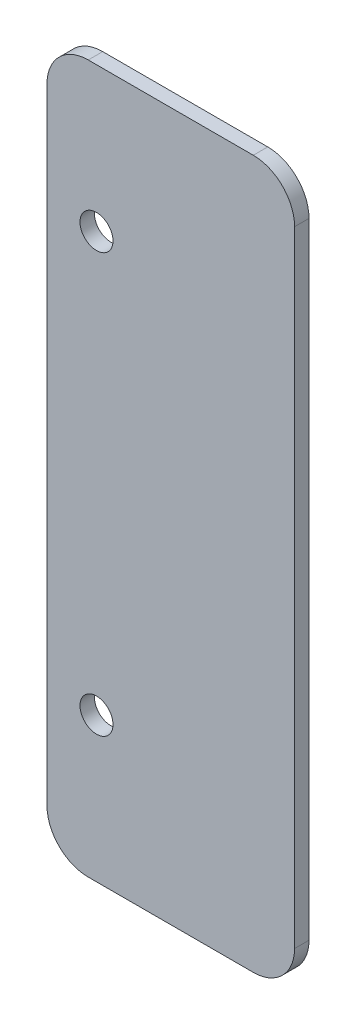
ISO-10303-21;
HEADER;
FILE_DESCRIPTION(('STEP AP214'),'2;1');
FILE_NAME('part.step','',(''),(''),'','','');
FILE_SCHEMA(('AUTOMOTIVE_DESIGN { 1 0 10303 214 1 1 1 1 }'));
ENDSEC;
DATA;
#1=APPLICATION_CONTEXT('core data for automotive mechanical design processes');
#2=APPLICATION_PROTOCOL_DEFINITION('international standard','automotive_design',2000,#1);
#3=PRODUCT_CONTEXT('',#1,'mechanical');
#4=PRODUCT('Part','Part','',(#3));
#5=PRODUCT_RELATED_PRODUCT_CATEGORY('part','',(#4));
#6=PRODUCT_DEFINITION_FORMATION('','',#4);
#7=PRODUCT_DEFINITION_CONTEXT('part definition',#1,'design');
#8=PRODUCT_DEFINITION('design','',#6,#7);
#9=PRODUCT_DEFINITION_SHAPE('','',#8);
#10=(LENGTH_UNIT() NAMED_UNIT(*) SI_UNIT(.MILLI.,.METRE.));
#11=(NAMED_UNIT(*) PLANE_ANGLE_UNIT() SI_UNIT($,.RADIAN.));
#12=(NAMED_UNIT(*) SI_UNIT($,.STERADIAN.) SOLID_ANGLE_UNIT());
#13=UNCERTAINTY_MEASURE_WITH_UNIT(LENGTH_MEASURE(1.E-05),#10,'distance_accuracy_value','');
#14=(GEOMETRIC_REPRESENTATION_CONTEXT(3) GLOBAL_UNCERTAINTY_ASSIGNED_CONTEXT((#13)) GLOBAL_UNIT_ASSIGNED_CONTEXT((#10,
#11,#12)) REPRESENTATION_CONTEXT('',''));
#15=CARTESIAN_POINT('',(0.,0.,0.));
#16=DIRECTION('',(0.,0.,1.));
#17=DIRECTION('',(1.,0.,0.));
#18=AXIS2_PLACEMENT_3D('',#15,#16,#17);
#19=CARTESIAN_POINT('',(2302.,-93.7499999999999,3.5));
#20=DIRECTION('',(0.,1.,0.));
#21=DIRECTION('',(0.,0.,1.));
#22=AXIS2_PLACEMENT_3D('',#19,#20,#21);
#23=PLANE('',#22);
#24=DIRECTION('',(1.,0.,0.));
#25=VECTOR('',#24,1.);
#26=CARTESIAN_POINT('',(2302.,-93.7499999999999,3.5));
#27=LINE('',#26,#25);
#28=CARTESIAN_POINT('',(2312.,-93.7499999999999,3.5));
#29=VERTEX_POINT('',#28);
#30=CARTESIAN_POINT('',(2352.,-93.7499999999999,3.5));
#31=VERTEX_POINT('',#30);
#32=EDGE_CURVE('E118',#29,#31,#27,.T.);
#33=ORIENTED_EDGE('',*,*,#32,.F.);
#34=DIRECTION('',(0.,0.,-1.));
#35=VECTOR('',#34,1.);
#36=CARTESIAN_POINT('',(2312.,-93.7499999999999,0.));
#37=LINE('',#36,#35);
#38=CARTESIAN_POINT('',(2312.,-93.7499999999999,0.));
#39=VERTEX_POINT('',#38);
#40=EDGE_CURVE('E103',#29,#39,#37,.T.);
#41=ORIENTED_EDGE('',*,*,#40,.T.);
#42=DIRECTION('',(1.,0.,0.));
#43=VECTOR('',#42,1.);
#44=CARTESIAN_POINT('',(2302.,-93.7499999999999,0.));
#45=LINE('',#44,#43);
#46=CARTESIAN_POINT('',(2352.,-93.7499999999999,0.));
#47=VERTEX_POINT('',#46);
#48=EDGE_CURVE('E115',#39,#47,#45,.T.);
#49=ORIENTED_EDGE('',*,*,#48,.T.);
#50=DIRECTION('',(0.,0.,-1.));
#51=VECTOR('',#50,1.);
#52=CARTESIAN_POINT('',(2352.,-93.7499999999999,3.5));
#53=LINE('',#52,#51);
#54=EDGE_CURVE('E120',#47,#31,#53,.F.);
#55=ORIENTED_EDGE('',*,*,#54,.T.);
#56=EDGE_LOOP('',(#33,#41,#49,#55));
#57=FACE_BOUND('',#56,.T.);
#58=ADVANCED_FACE('F34',(#57),#23,.F.);
#59=CARTESIAN_POINT('',(2362.,-93.7499999999999,3.5));
#60=DIRECTION('',(-1.,0.,0.));
#61=DIRECTION('',(0.,0.,1.));
#62=AXIS2_PLACEMENT_3D('',#59,#60,#61);
#63=PLANE('',#62);
#64=DIRECTION('',(0.,1.,0.));
#65=VECTOR('',#64,1.);
#66=CARTESIAN_POINT('',(2362.,-93.7499999999999,3.5));
#67=LINE('',#66,#65);
#68=CARTESIAN_POINT('',(2362.,-83.7499999999999,3.5));
#69=VERTEX_POINT('',#68);
#70=CARTESIAN_POINT('',(2362.,67.7500000000003,3.5));
#71=VERTEX_POINT('',#70);
#72=EDGE_CURVE('E173',#69,#71,#67,.T.);
#73=ORIENTED_EDGE('',*,*,#72,.F.);
#74=DIRECTION('',(0.,0.,-1.));
#75=VECTOR('',#74,1.);
#76=CARTESIAN_POINT('',(2362.,-83.7499999999999,3.5));
#77=LINE('',#76,#75);
#78=CARTESIAN_POINT('',(2362.,-83.7499999999999,0.));
#79=VERTEX_POINT('',#78);
#80=EDGE_CURVE('E158',#69,#79,#77,.T.);
#81=ORIENTED_EDGE('',*,*,#80,.T.);
#82=DIRECTION('',(0.,1.,0.));
#83=VECTOR('',#82,1.);
#84=CARTESIAN_POINT('',(2362.,-93.7499999999999,0.));
#85=LINE('',#84,#83);
#86=CARTESIAN_POINT('',(2362.,67.7500000000003,0.));
#87=VERTEX_POINT('',#86);
#88=EDGE_CURVE('E124',#79,#87,#85,.T.);
#89=ORIENTED_EDGE('',*,*,#88,.T.);
#90=DIRECTION('',(0.,0.,-1.));
#91=VECTOR('',#90,1.);
#92=CARTESIAN_POINT('',(2362.,67.7500000000003,3.5));
#93=LINE('',#92,#91);
#94=EDGE_CURVE('E156',#87,#71,#93,.F.);
#95=ORIENTED_EDGE('',*,*,#94,.T.);
#96=EDGE_LOOP('',(#73,#81,#89,#95));
#97=FACE_BOUND('',#96,.T.);
#98=ADVANCED_FACE('F212',(#97),#63,.F.);
#99=CARTESIAN_POINT('',(2302.,77.7500000000003,3.5));
#100=DIRECTION('',(0.,1.,0.));
#101=DIRECTION('',(0.,0.,1.));
#102=AXIS2_PLACEMENT_3D('',#99,#100,#101);
#103=PLANE('',#102);
#104=DIRECTION('',(1.,0.,0.));
#105=VECTOR('',#104,1.);
#106=CARTESIAN_POINT('',(2302.,77.7500000000003,0.));
#107=LINE('',#106,#105);
#108=CARTESIAN_POINT('',(2312.,77.7500000000003,0.));
#109=VERTEX_POINT('',#108);
#110=CARTESIAN_POINT('',(2352.,77.7500000000003,0.));
#111=VERTEX_POINT('',#110);
#112=EDGE_CURVE('E128',#109,#111,#107,.T.);
#113=ORIENTED_EDGE('',*,*,#112,.F.);
#114=DIRECTION('',(0.,0.,-1.));
#115=VECTOR('',#114,1.);
#116=CARTESIAN_POINT('',(2312.,77.7500000000003,3.5));
#117=LINE('',#116,#115);
#118=CARTESIAN_POINT('',(2312.,77.7500000000003,3.5));
#119=VERTEX_POINT('',#118);
#120=EDGE_CURVE('E11',#109,#119,#117,.F.);
#121=ORIENTED_EDGE('',*,*,#120,.T.);
#122=DIRECTION('',(1.,0.,0.));
#123=VECTOR('',#122,1.);
#124=CARTESIAN_POINT('',(2302.,77.7500000000003,3.5));
#125=LINE('',#124,#123);
#126=CARTESIAN_POINT('',(2352.,77.7500000000003,3.5));
#127=VERTEX_POINT('',#126);
#128=EDGE_CURVE('E163',#119,#127,#125,.T.);
#129=ORIENTED_EDGE('',*,*,#128,.T.);
#130=DIRECTION('',(0.,0.,-1.));
#131=VECTOR('',#130,1.);
#132=CARTESIAN_POINT('',(2352.,77.7500000000003,0.));
#133=LINE('',#132,#131);
#134=EDGE_CURVE('E42',#127,#111,#133,.T.);
#135=ORIENTED_EDGE('',*,*,#134,.T.);
#136=EDGE_LOOP('',(#113,#121,#129,#135));
#137=FACE_BOUND('',#136,.T.);
#138=ADVANCED_FACE('F162',(#137),#103,.T.);
#139=CARTESIAN_POINT('',(2302.,-93.7499999999999,3.5));
#140=DIRECTION('',(-1.,0.,0.));
#141=DIRECTION('',(0.,0.,1.));
#142=AXIS2_PLACEMENT_3D('',#139,#140,#141);
#143=PLANE('',#142);
#144=DIRECTION('',(0.,1.,0.));
#145=VECTOR('',#144,1.);
#146=CARTESIAN_POINT('',(2302.,-93.7499999999999,0.));
#147=LINE('',#146,#145);
#148=CARTESIAN_POINT('',(2302.,-83.7499999999999,0.));
#149=VERTEX_POINT('',#148);
#150=CARTESIAN_POINT('',(2302.,67.7500000000003,0.));
#151=VERTEX_POINT('',#150);
#152=EDGE_CURVE('E139',#149,#151,#147,.T.);
#153=ORIENTED_EDGE('',*,*,#152,.F.);
#154=DIRECTION('',(0.,0.,-1.));
#155=VECTOR('',#154,1.);
#156=CARTESIAN_POINT('',(2302.,-83.7499999999999,3.5));
#157=LINE('',#156,#155);
#158=CARTESIAN_POINT('',(2302.,-83.7499999999999,3.5));
#159=VERTEX_POINT('',#158);
#160=EDGE_CURVE('E104',#149,#159,#157,.F.);
#161=ORIENTED_EDGE('',*,*,#160,.T.);
#162=DIRECTION('',(0.,1.,0.));
#163=VECTOR('',#162,1.);
#164=CARTESIAN_POINT('',(2302.,-93.7499999999999,3.5));
#165=LINE('',#164,#163);
#166=CARTESIAN_POINT('',(2302.,67.7500000000003,3.5));
#167=VERTEX_POINT('',#166);
#168=EDGE_CURVE('E134',#159,#167,#165,.T.);
#169=ORIENTED_EDGE('',*,*,#168,.T.);
#170=DIRECTION('',(0.,0.,-1.));
#171=VECTOR('',#170,1.);
#172=CARTESIAN_POINT('',(2302.,67.7500000000003,3.5));
#173=LINE('',#172,#171);
#174=EDGE_CURVE('E109',#167,#151,#173,.T.);
#175=ORIENTED_EDGE('',*,*,#174,.T.);
#176=EDGE_LOOP('',(#153,#161,#169,#175));
#177=FACE_BOUND('',#176,.T.);
#178=ADVANCED_FACE('F171',(#177),#143,.T.);
#179=CARTESIAN_POINT('',(0.,0.,3.5));
#180=DIRECTION('',(0.,0.,1.));
#181=DIRECTION('',(1.,0.,0.));
#182=AXIS2_PLACEMENT_3D('',#179,#180,#181);
#183=PLANE('',#182);
#184=CARTESIAN_POINT('',(2314.,42.7500000000003,3.5));
#185=DIRECTION('',(0.,0.,1.));
#186=DIRECTION('',(1.,0.,0.));
#187=AXIS2_PLACEMENT_3D('',#184,#185,#186);
#188=CIRCLE('',#187,4.00000000000021);
#189=CARTESIAN_POINT('',(2318.,42.7500000000003,3.5));
#190=VERTEX_POINT('',#189);
#191=EDGE_CURVE('E131',#190,#190,#188,.T.);
#192=ORIENTED_EDGE('',*,*,#191,.F.);
#193=EDGE_LOOP('',(#192));
#194=FACE_BOUND('',#193,.T.);
#195=CARTESIAN_POINT('',(2314.,-58.7499999999999,3.5));
#196=DIRECTION('',(0.,0.,1.));
#197=DIRECTION('',(1.,0.,0.));
#198=AXIS2_PLACEMENT_3D('',#195,#196,#197);
#199=CIRCLE('',#198,4.00000000000021);
#200=CARTESIAN_POINT('',(2318.,-58.7499999999999,3.5));
#201=VERTEX_POINT('',#200);
#202=EDGE_CURVE('E180',#201,#201,#199,.T.);
#203=ORIENTED_EDGE('',*,*,#202,.F.);
#204=EDGE_LOOP('',(#203));
#205=FACE_BOUND('',#204,.T.);
#206=ORIENTED_EDGE('',*,*,#168,.F.);
#207=CARTESIAN_POINT('',(2312.,-83.7499999999999,3.5));
#208=DIRECTION('',(0.,0.,1.));
#209=DIRECTION('',(1.,0.,0.));
#210=AXIS2_PLACEMENT_3D('',#207,#208,#209);
#211=CIRCLE('',#210,10.);
#212=EDGE_CURVE('E154',#159,#29,#211,.T.);
#213=ORIENTED_EDGE('',*,*,#212,.T.);
#214=ORIENTED_EDGE('',*,*,#32,.T.);
#215=CARTESIAN_POINT('',(2352.,-83.7499999999999,3.5));
#216=DIRECTION('',(0.,0.,1.));
#217=DIRECTION('',(1.,0.,0.));
#218=AXIS2_PLACEMENT_3D('',#215,#216,#217);
#219=CIRCLE('',#218,10.);
#220=EDGE_CURVE('E152',#31,#69,#219,.T.);
#221=ORIENTED_EDGE('',*,*,#220,.T.);
#222=ORIENTED_EDGE('',*,*,#72,.T.);
#223=CARTESIAN_POINT('',(2352.,67.7500000000003,3.5));
#224=DIRECTION('',(0.,0.,1.));
#225=DIRECTION('',(1.,0.,0.));
#226=AXIS2_PLACEMENT_3D('',#223,#224,#225);
#227=CIRCLE('',#226,10.);
#228=EDGE_CURVE('E49',#71,#127,#227,.T.);
#229=ORIENTED_EDGE('',*,*,#228,.T.);
#230=ORIENTED_EDGE('',*,*,#128,.F.);
#231=CARTESIAN_POINT('',(2312.,67.7500000000003,3.5));
#232=DIRECTION('',(0.,0.,1.));
#233=DIRECTION('',(1.,0.,0.));
#234=AXIS2_PLACEMENT_3D('',#231,#232,#233);
#235=CIRCLE('',#234,10.);
#236=EDGE_CURVE('E150',#119,#167,#235,.T.);
#237=ORIENTED_EDGE('',*,*,#236,.T.);
#238=EDGE_LOOP('',(#206,#213,#214,#221,#222,#229,#230,#237));
#239=FACE_BOUND('',#238,.T.);
#240=ADVANCED_FACE('F189',(#194,#205,#239),#183,.T.);
#241=CARTESIAN_POINT('',(0.,0.,0.));
#242=DIRECTION('',(0.,0.,1.));
#243=DIRECTION('',(1.,0.,0.));
#244=AXIS2_PLACEMENT_3D('',#241,#242,#243);
#245=PLANE('',#244);
#246=CARTESIAN_POINT('',(2314.,42.7500000000003,0.));
#247=DIRECTION('',(0.,0.,1.));
#248=DIRECTION('',(1.,0.,0.));
#249=AXIS2_PLACEMENT_3D('',#246,#247,#248);
#250=CIRCLE('',#249,4.00000000000021);
#251=CARTESIAN_POINT('',(2318.,42.7500000000003,0.));
#252=VERTEX_POINT('',#251);
#253=EDGE_CURVE('E125',#252,#252,#250,.F.);
#254=ORIENTED_EDGE('',*,*,#253,.F.);
#255=EDGE_LOOP('',(#254));
#256=FACE_BOUND('',#255,.T.);
#257=CARTESIAN_POINT('',(2314.,-58.7499999999999,0.));
#258=DIRECTION('',(0.,0.,1.));
#259=DIRECTION('',(1.,0.,0.));
#260=AXIS2_PLACEMENT_3D('',#257,#258,#259);
#261=CIRCLE('',#260,4.00000000000021);
#262=CARTESIAN_POINT('',(2318.,-58.7499999999999,0.));
#263=VERTEX_POINT('',#262);
#264=EDGE_CURVE('E177',#263,#263,#261,.F.);
#265=ORIENTED_EDGE('',*,*,#264,.F.);
#266=EDGE_LOOP('',(#265));
#267=FACE_BOUND('',#266,.T.);
#268=ORIENTED_EDGE('',*,*,#48,.F.);
#269=CARTESIAN_POINT('',(2312.,-83.7499999999999,0.));
#270=DIRECTION('',(0.,0.,1.));
#271=DIRECTION('',(1.,0.,0.));
#272=AXIS2_PLACEMENT_3D('',#269,#270,#271);
#273=CIRCLE('',#272,10.);
#274=EDGE_CURVE('E99',#39,#149,#273,.F.);
#275=ORIENTED_EDGE('',*,*,#274,.T.);
#276=ORIENTED_EDGE('',*,*,#152,.T.);
#277=CARTESIAN_POINT('',(2312.,67.7500000000003,0.));
#278=DIRECTION('',(0.,0.,1.));
#279=DIRECTION('',(1.,0.,0.));
#280=AXIS2_PLACEMENT_3D('',#277,#278,#279);
#281=CIRCLE('',#280,10.);
#282=EDGE_CURVE('E143',#151,#109,#281,.F.);
#283=ORIENTED_EDGE('',*,*,#282,.T.);
#284=ORIENTED_EDGE('',*,*,#112,.T.);
#285=CARTESIAN_POINT('',(2352.,67.7500000000003,0.));
#286=DIRECTION('',(0.,0.,1.));
#287=DIRECTION('',(1.,0.,0.));
#288=AXIS2_PLACEMENT_3D('',#285,#286,#287);
#289=CIRCLE('',#288,10.);
#290=EDGE_CURVE('E119',#111,#87,#289,.F.);
#291=ORIENTED_EDGE('',*,*,#290,.T.);
#292=ORIENTED_EDGE('',*,*,#88,.F.);
#293=CARTESIAN_POINT('',(2352.,-83.7499999999999,0.));
#294=DIRECTION('',(0.,0.,1.));
#295=DIRECTION('',(1.,0.,0.));
#296=AXIS2_PLACEMENT_3D('',#293,#294,#295);
#297=CIRCLE('',#296,10.);
#298=EDGE_CURVE('E110',#79,#47,#297,.F.);
#299=ORIENTED_EDGE('',*,*,#298,.T.);
#300=EDGE_LOOP('',(#268,#275,#276,#283,#284,#291,#292,#299));
#301=FACE_BOUND('',#300,.T.);
#302=ADVANCED_FACE('F122',(#256,#267,#301),#245,.F.);
#303=CARTESIAN_POINT('',(2312.,-83.7499999999999,3.5));
#304=DIRECTION('',(0.,0.,1.));
#305=DIRECTION('',(1.,0.,0.));
#306=AXIS2_PLACEMENT_3D('',#303,#304,#305);
#307=CYLINDRICAL_SURFACE('',#306,10.);
#308=ORIENTED_EDGE('',*,*,#212,.F.);
#309=ORIENTED_EDGE('',*,*,#160,.F.);
#310=ORIENTED_EDGE('',*,*,#274,.F.);
#311=ORIENTED_EDGE('',*,*,#40,.F.);
#312=EDGE_LOOP('',(#308,#309,#310,#311));
#313=FACE_BOUND('',#312,.T.);
#314=ADVANCED_FACE('F102',(#313),#307,.T.);
#315=CARTESIAN_POINT('',(2352.,-83.7499999999999,3.5));
#316=DIRECTION('',(0.,0.,-1.));
#317=DIRECTION('',(-1.,0.,0.));
#318=AXIS2_PLACEMENT_3D('',#315,#316,#317);
#319=CYLINDRICAL_SURFACE('',#318,10.);
#320=ORIENTED_EDGE('',*,*,#220,.F.);
#321=ORIENTED_EDGE('',*,*,#54,.F.);
#322=ORIENTED_EDGE('',*,*,#298,.F.);
#323=ORIENTED_EDGE('',*,*,#80,.F.);
#324=EDGE_LOOP('',(#320,#321,#322,#323));
#325=FACE_BOUND('',#324,.T.);
#326=ADVANCED_FACE('F207',(#325),#319,.T.);
#327=CARTESIAN_POINT('',(2312.,67.7500000000003,3.5));
#328=DIRECTION('',(0.,0.,-1.));
#329=DIRECTION('',(-1.,0.,0.));
#330=AXIS2_PLACEMENT_3D('',#327,#328,#329);
#331=CYLINDRICAL_SURFACE('',#330,10.);
#332=ORIENTED_EDGE('',*,*,#236,.F.);
#333=ORIENTED_EDGE('',*,*,#120,.F.);
#334=ORIENTED_EDGE('',*,*,#282,.F.);
#335=ORIENTED_EDGE('',*,*,#174,.F.);
#336=EDGE_LOOP('',(#332,#333,#334,#335));
#337=FACE_BOUND('',#336,.T.);
#338=ADVANCED_FACE('F168',(#337),#331,.T.);
#339=CARTESIAN_POINT('',(2352.,67.7500000000003,3.5));
#340=DIRECTION('',(0.,0.,1.));
#341=DIRECTION('',(1.,0.,0.));
#342=AXIS2_PLACEMENT_3D('',#339,#340,#341);
#343=CYLINDRICAL_SURFACE('',#342,10.);
#344=ORIENTED_EDGE('',*,*,#228,.F.);
#345=ORIENTED_EDGE('',*,*,#94,.F.);
#346=ORIENTED_EDGE('',*,*,#290,.F.);
#347=ORIENTED_EDGE('',*,*,#134,.F.);
#348=EDGE_LOOP('',(#344,#345,#346,#347));
#349=FACE_BOUND('',#348,.T.);
#350=ADVANCED_FACE('F36',(#349),#343,.T.);
#351=CARTESIAN_POINT('',(2314.,-58.7499999999999,-0.00100000000000013));
#352=DIRECTION('',(0.,0.,1.));
#353=DIRECTION('',(1.,0.,0.));
#354=AXIS2_PLACEMENT_3D('',#351,#352,#353);
#355=CYLINDRICAL_SURFACE('',#354,4.00000000000021);
#356=ORIENTED_EDGE('',*,*,#202,.T.);
#357=EDGE_LOOP('',(#356));
#358=FACE_BOUND('',#357,.T.);
#359=ORIENTED_EDGE('',*,*,#264,.T.);
#360=EDGE_LOOP('',(#359));
#361=FACE_BOUND('',#360,.T.);
#362=ADVANCED_FACE('F195',(#358,#361),#355,.F.);
#363=CARTESIAN_POINT('',(2314.,42.7500000000003,-0.00100000000000013));
#364=DIRECTION('',(0.,0.,1.));
#365=DIRECTION('',(1.,0.,0.));
#366=AXIS2_PLACEMENT_3D('',#363,#364,#365);
#367=CYLINDRICAL_SURFACE('',#366,4.00000000000021);
#368=ORIENTED_EDGE('',*,*,#191,.T.);
#369=EDGE_LOOP('',(#368));
#370=FACE_BOUND('',#369,.T.);
#371=ORIENTED_EDGE('',*,*,#253,.T.);
#372=EDGE_LOOP('',(#371));
#373=FACE_BOUND('',#372,.T.);
#374=ADVANCED_FACE('F186',(#370,#373),#367,.F.);
#375=CLOSED_SHELL('',(#58,#98,#138,#178,#240,#302,#314,#326,#338,#350,#362,#374));
#376=MANIFOLD_SOLID_BREP('B2',#375);
#377=ADVANCED_BREP_SHAPE_REPRESENTATION('',(#18,#376),#14);
#378=SHAPE_DEFINITION_REPRESENTATION(#9,#377);
ENDSEC;
END-ISO-10303-21;
